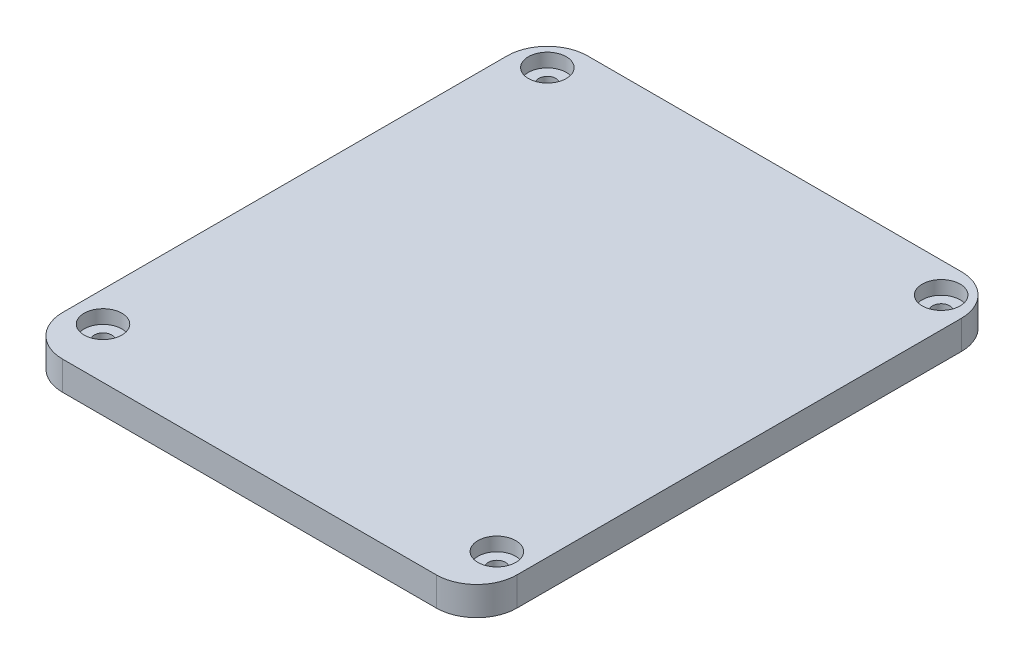
ISO-10303-21;
HEADER;
FILE_DESCRIPTION(('STEP AP214'),'2;1');
FILE_NAME('part.step','',(''),(''),'','','');
FILE_SCHEMA(('AUTOMOTIVE_DESIGN { 1 0 10303 214 1 1 1 1 }'));
ENDSEC;
DATA;
#1=APPLICATION_CONTEXT('core data for automotive mechanical design processes');
#2=APPLICATION_PROTOCOL_DEFINITION('international standard','automotive_design',2000,#1);
#3=PRODUCT_CONTEXT('',#1,'mechanical');
#4=PRODUCT('Part','Part','',(#3));
#5=PRODUCT_RELATED_PRODUCT_CATEGORY('part','',(#4));
#6=PRODUCT_DEFINITION_FORMATION('','',#4);
#7=PRODUCT_DEFINITION_CONTEXT('part definition',#1,'design');
#8=PRODUCT_DEFINITION('design','',#6,#7);
#9=PRODUCT_DEFINITION_SHAPE('','',#8);
#10=(LENGTH_UNIT() NAMED_UNIT(*) SI_UNIT(.MILLI.,.METRE.));
#11=(NAMED_UNIT(*) PLANE_ANGLE_UNIT() SI_UNIT($,.RADIAN.));
#12=(NAMED_UNIT(*) SI_UNIT($,.STERADIAN.) SOLID_ANGLE_UNIT());
#13=UNCERTAINTY_MEASURE_WITH_UNIT(LENGTH_MEASURE(1.E-05),#10,'distance_accuracy_value','');
#14=(GEOMETRIC_REPRESENTATION_CONTEXT(3) GLOBAL_UNCERTAINTY_ASSIGNED_CONTEXT((#13)) GLOBAL_UNIT_ASSIGNED_CONTEXT((#10,
#11,#12)) REPRESENTATION_CONTEXT('',''));
#15=CARTESIAN_POINT('',(0.,0.,0.));
#16=DIRECTION('',(0.,0.,1.));
#17=DIRECTION('',(1.,0.,0.));
#18=AXIS2_PLACEMENT_3D('',#15,#16,#17);
#19=CARTESIAN_POINT('',(0.,3.,0.));
#20=DIRECTION('',(0.,1.,0.));
#21=DIRECTION('',(0.,0.,1.));
#22=AXIS2_PLACEMENT_3D('',#19,#20,#21);
#23=PLANE('',#22);
#24=CARTESIAN_POINT('',(-39.,3.,-44.));
#25=DIRECTION('',(0.,1.,0.));
#26=DIRECTION('',(0.,0.,1.));
#27=AXIS2_PLACEMENT_3D('',#24,#25,#26);
#28=CIRCLE('',#27,1.7);
#29=CARTESIAN_POINT('',(-39.,3.,-42.3));
#30=VERTEX_POINT('',#29);
#31=EDGE_CURVE('E235',#30,#30,#28,.T.);
#32=ORIENTED_EDGE('',*,*,#31,.F.);
#33=EDGE_LOOP('',(#32));
#34=FACE_BOUND('',#33,.T.);
#35=CARTESIAN_POINT('',(-39.,3.,-44.));
#36=DIRECTION('',(0.,1.,0.));
#37=DIRECTION('',(0.,0.,1.));
#38=AXIS2_PLACEMENT_3D('',#35,#36,#37);
#39=CIRCLE('',#38,3.75);
#40=CARTESIAN_POINT('',(-39.,3.,-40.25));
#41=VERTEX_POINT('',#40);
#42=EDGE_CURVE('E286',#41,#41,#39,.F.);
#43=ORIENTED_EDGE('',*,*,#42,.F.);
#44=EDGE_LOOP('',(#43));
#45=FACE_BOUND('',#44,.T.);
#46=ADVANCED_FACE('F32',(#34,#45),#23,.T.);
#47=CARTESIAN_POINT('',(39.,3.,-44.));
#48=DIRECTION('',(0.,1.,0.));
#49=DIRECTION('',(0.,0.,1.));
#50=AXIS2_PLACEMENT_3D('',#47,#48,#49);
#51=CIRCLE('',#50,1.7);
#52=CARTESIAN_POINT('',(39.,3.,-42.3));
#53=VERTEX_POINT('',#52);
#54=EDGE_CURVE('E236',#53,#53,#51,.T.);
#55=ORIENTED_EDGE('',*,*,#54,.F.);
#56=EDGE_LOOP('',(#55));
#57=FACE_BOUND('',#56,.T.);
#58=CARTESIAN_POINT('',(39.,3.,-44.));
#59=DIRECTION('',(0.,1.,0.));
#60=DIRECTION('',(0.,0.,1.));
#61=AXIS2_PLACEMENT_3D('',#58,#59,#60);
#62=CIRCLE('',#61,3.75000000000001);
#63=CARTESIAN_POINT('',(39.,3.,-40.25));
#64=VERTEX_POINT('',#63);
#65=EDGE_CURVE('E283',#64,#64,#62,.F.);
#66=ORIENTED_EDGE('',*,*,#65,.F.);
#67=EDGE_LOOP('',(#66));
#68=FACE_BOUND('',#67,.T.);
#69=ADVANCED_FACE('F481',(#57,#68),#23,.T.);
#70=CARTESIAN_POINT('',(-39.,3.,44.));
#71=DIRECTION('',(0.,1.,0.));
#72=DIRECTION('',(0.,0.,1.));
#73=AXIS2_PLACEMENT_3D('',#70,#71,#72);
#74=CIRCLE('',#73,1.7);
#75=CARTESIAN_POINT('',(-39.,3.,45.7));
#76=VERTEX_POINT('',#75);
#77=EDGE_CURVE('E248',#76,#76,#74,.T.);
#78=ORIENTED_EDGE('',*,*,#77,.F.);
#79=EDGE_LOOP('',(#78));
#80=FACE_BOUND('',#79,.T.);
#81=CARTESIAN_POINT('',(-39.,3.,44.));
#82=DIRECTION('',(0.,1.,0.));
#83=DIRECTION('',(0.,0.,1.));
#84=AXIS2_PLACEMENT_3D('',#81,#82,#83);
#85=CIRCLE('',#84,3.75);
#86=CARTESIAN_POINT('',(-39.,3.,47.75));
#87=VERTEX_POINT('',#86);
#88=EDGE_CURVE('E280',#87,#87,#85,.F.);
#89=ORIENTED_EDGE('',*,*,#88,.F.);
#90=EDGE_LOOP('',(#89));
#91=FACE_BOUND('',#90,.T.);
#92=ADVANCED_FACE('F488',(#80,#91),#23,.T.);
#93=CARTESIAN_POINT('',(39.,3.,44.));
#94=DIRECTION('',(0.,1.,0.));
#95=DIRECTION('',(0.,0.,1.));
#96=AXIS2_PLACEMENT_3D('',#93,#94,#95);
#97=CIRCLE('',#96,1.7);
#98=CARTESIAN_POINT('',(39.,3.,45.7));
#99=VERTEX_POINT('',#98);
#100=EDGE_CURVE('E242',#99,#99,#97,.T.);
#101=ORIENTED_EDGE('',*,*,#100,.F.);
#102=EDGE_LOOP('',(#101));
#103=FACE_BOUND('',#102,.T.);
#104=CARTESIAN_POINT('',(39.,3.,44.));
#105=DIRECTION('',(0.,1.,0.));
#106=DIRECTION('',(0.,0.,1.));
#107=AXIS2_PLACEMENT_3D('',#104,#105,#106);
#108=CIRCLE('',#107,3.75000000000001);
#109=CARTESIAN_POINT('',(39.,3.,47.75));
#110=VERTEX_POINT('',#109);
#111=EDGE_CURVE('E277',#110,#110,#108,.F.);
#112=ORIENTED_EDGE('',*,*,#111,.F.);
#113=EDGE_LOOP('',(#112));
#114=FACE_BOUND('',#113,.T.);
#115=ADVANCED_FACE('F484',(#103,#114),#23,.T.);
#116=CARTESIAN_POINT('',(0.,-2.,0.));
#117=DIRECTION('',(0.,1.,0.));
#118=DIRECTION('',(0.,0.,1.));
#119=AXIS2_PLACEMENT_3D('',#116,#117,#118);
#120=PLANE('',#119);
#121=DIRECTION('',(-1.,0.,0.));
#122=VECTOR('',#121,1.);
#123=CARTESIAN_POINT('',(41.6,-2.,46.6));
#124=LINE('',#123,#122);
#125=CARTESIAN_POINT('',(33.5925976661617,-2.,46.6));
#126=VERTEX_POINT('',#125);
#127=CARTESIAN_POINT('',(-33.5925976661617,-2.,46.6));
#128=VERTEX_POINT('',#127);
#129=EDGE_CURVE('E251',#126,#128,#124,.T.);
#130=ORIENTED_EDGE('',*,*,#129,.T.);
#131=CARTESIAN_POINT('',(-39.,-2.,44.));
#132=DIRECTION('',(0.,1.,0.));
#133=DIRECTION('',(0.,0.,1.));
#134=AXIS2_PLACEMENT_3D('',#131,#132,#133);
#135=CIRCLE('',#134,5.99999999999997);
#136=CARTESIAN_POINT('',(-33.0133481811617,-2.,43.6));
#137=VERTEX_POINT('',#136);
#138=EDGE_CURVE('E355',#128,#137,#135,.T.);
#139=ORIENTED_EDGE('',*,*,#138,.T.);
#140=DIRECTION('',(-1.,0.,0.));
#141=VECTOR('',#140,1.);
#142=CARTESIAN_POINT('',(38.6,-2.,43.6));
#143=LINE('',#142,#141);
#144=CARTESIAN_POINT('',(33.0133481811617,-2.,43.6));
#145=VERTEX_POINT('',#144);
#146=EDGE_CURVE('E228',#145,#137,#143,.T.);
#147=ORIENTED_EDGE('',*,*,#146,.F.);
#148=CARTESIAN_POINT('',(39.,-2.,44.));
#149=DIRECTION('',(0.,1.,0.));
#150=DIRECTION('',(0.,0.,1.));
#151=AXIS2_PLACEMENT_3D('',#148,#149,#150);
#152=CIRCLE('',#151,5.99999999999997);
#153=EDGE_CURVE('E215',#145,#126,#152,.T.);
#154=ORIENTED_EDGE('',*,*,#153,.T.);
#155=EDGE_LOOP('',(#130,#139,#147,#154));
#156=FACE_BOUND('',#155,.T.);
#157=ADVANCED_FACE('F465',(#156),#120,.F.);
#158=DIRECTION('',(0.,0.,1.));
#159=VECTOR('',#158,1.);
#160=CARTESIAN_POINT('',(41.6,-2.,46.6));
#161=LINE('',#160,#159);
#162=CARTESIAN_POINT('',(41.6,-2.,-38.5925976661617));
#163=VERTEX_POINT('',#162);
#164=CARTESIAN_POINT('',(41.6,-2.,38.5925976661617));
#165=VERTEX_POINT('',#164);
#166=EDGE_CURVE('E426',#163,#165,#161,.T.);
#167=ORIENTED_EDGE('',*,*,#166,.T.);
#168=CARTESIAN_POINT('',(38.6,-2.,38.0133481811617));
#169=VERTEX_POINT('',#168);
#170=EDGE_CURVE('E199',#165,#169,#152,.T.);
#171=ORIENTED_EDGE('',*,*,#170,.T.);
#172=DIRECTION('',(0.,0.,1.));
#173=VECTOR('',#172,1.);
#174=CARTESIAN_POINT('',(38.6,-2.,43.6));
#175=LINE('',#174,#173);
#176=CARTESIAN_POINT('',(38.6,-2.,-38.0133481811617));
#177=VERTEX_POINT('',#176);
#178=EDGE_CURVE('E410',#177,#169,#175,.T.);
#179=ORIENTED_EDGE('',*,*,#178,.F.);
#180=CARTESIAN_POINT('',(39.,-2.,-44.));
#181=DIRECTION('',(0.,1.,0.));
#182=DIRECTION('',(0.,0.,1.));
#183=AXIS2_PLACEMENT_3D('',#180,#181,#182);
#184=CIRCLE('',#183,5.99999999999997);
#185=EDGE_CURVE('E365',#177,#163,#184,.T.);
#186=ORIENTED_EDGE('',*,*,#185,.T.);
#187=EDGE_LOOP('',(#167,#171,#179,#186));
#188=FACE_BOUND('',#187,.T.);
#189=ADVANCED_FACE('F500',(#188),#120,.F.);
#190=DIRECTION('',(1.,0.,0.));
#191=VECTOR('',#190,1.);
#192=CARTESIAN_POINT('',(41.6,-2.,-46.6));
#193=LINE('',#192,#191);
#194=CARTESIAN_POINT('',(-33.5925976661617,-2.,-46.6));
#195=VERTEX_POINT('',#194);
#196=CARTESIAN_POINT('',(33.5925976661617,-2.,-46.6));
#197=VERTEX_POINT('',#196);
#198=EDGE_CURVE('E423',#195,#197,#193,.T.);
#199=ORIENTED_EDGE('',*,*,#198,.T.);
#200=CARTESIAN_POINT('',(33.0133481811617,-2.,-43.6));
#201=VERTEX_POINT('',#200);
#202=EDGE_CURVE('E364',#197,#201,#184,.T.);
#203=ORIENTED_EDGE('',*,*,#202,.T.);
#204=DIRECTION('',(1.,0.,0.));
#205=VECTOR('',#204,1.);
#206=CARTESIAN_POINT('',(38.6,-2.,-43.6));
#207=LINE('',#206,#205);
#208=CARTESIAN_POINT('',(-33.0133481811617,-2.,-43.6));
#209=VERTEX_POINT('',#208);
#210=EDGE_CURVE('E406',#209,#201,#207,.T.);
#211=ORIENTED_EDGE('',*,*,#210,.F.);
#212=CARTESIAN_POINT('',(-39.,-2.,-44.));
#213=DIRECTION('',(0.,1.,0.));
#214=DIRECTION('',(0.,0.,1.));
#215=AXIS2_PLACEMENT_3D('',#212,#213,#214);
#216=CIRCLE('',#215,5.99999999999997);
#217=EDGE_CURVE('E391',#209,#195,#216,.T.);
#218=ORIENTED_EDGE('',*,*,#217,.T.);
#219=EDGE_LOOP('',(#199,#203,#211,#218));
#220=FACE_BOUND('',#219,.T.);
#221=ADVANCED_FACE('F558',(#220),#120,.F.);
#222=CARTESIAN_POINT('',(-45.,3.,50.));
#223=DIRECTION('',(1.,0.,0.));
#224=DIRECTION('',(0.,0.,-1.));
#225=AXIS2_PLACEMENT_3D('',#222,#223,#224);
#226=PLANE('',#225);
#227=DIRECTION('',(0.,0.,1.));
#228=VECTOR('',#227,1.);
#229=CARTESIAN_POINT('',(-45.,0.,50.));
#230=LINE('',#229,#228);
#231=CARTESIAN_POINT('',(-45.,0.,-42.));
#232=VERTEX_POINT('',#231);
#233=CARTESIAN_POINT('',(-45.,0.,46.));
#234=VERTEX_POINT('',#233);
#235=EDGE_CURVE('E255',#232,#234,#230,.T.);
#236=ORIENTED_EDGE('',*,*,#235,.T.);
#237=DIRECTION('',(0.,-1.,0.));
#238=VECTOR('',#237,1.);
#239=CARTESIAN_POINT('',(-45.,5.7,46.));
#240=LINE('',#239,#238);
#241=CARTESIAN_POINT('',(-45.,5.7,46.));
#242=VERTEX_POINT('',#241);
#243=EDGE_CURVE('E306',#234,#242,#240,.F.);
#244=ORIENTED_EDGE('',*,*,#243,.T.);
#245=DIRECTION('',(0.,0.,1.));
#246=VECTOR('',#245,1.);
#247=CARTESIAN_POINT('',(-45.,5.7,50.));
#248=LINE('',#247,#246);
#249=CARTESIAN_POINT('',(-45.,5.7,-42.));
#250=VERTEX_POINT('',#249);
#251=EDGE_CURVE('E344',#250,#242,#248,.T.);
#252=ORIENTED_EDGE('',*,*,#251,.F.);
#253=DIRECTION('',(0.,-1.,0.));
#254=VECTOR('',#253,1.);
#255=CARTESIAN_POINT('',(-45.,3.,-42.));
#256=LINE('',#255,#254);
#257=EDGE_CURVE('E303',#250,#232,#256,.T.);
#258=ORIENTED_EDGE('',*,*,#257,.T.);
#259=EDGE_LOOP('',(#236,#244,#252,#258));
#260=FACE_BOUND('',#259,.T.);
#261=ADVANCED_FACE('F568',(#260),#226,.F.);
#262=CARTESIAN_POINT('',(45.,3.,50.));
#263=DIRECTION('',(-1.,0.,0.));
#264=DIRECTION('',(0.,0.,1.));
#265=AXIS2_PLACEMENT_3D('',#262,#263,#264);
#266=PLANE('',#265);
#267=DIRECTION('',(0.,0.,-1.));
#268=VECTOR('',#267,1.);
#269=CARTESIAN_POINT('',(45.,5.7,54.));
#270=LINE('',#269,#268);
#271=CARTESIAN_POINT('',(45.,5.7,46.));
#272=VERTEX_POINT('',#271);
#273=CARTESIAN_POINT('',(45.,5.7,-42.));
#274=VERTEX_POINT('',#273);
#275=EDGE_CURVE('E324',#272,#274,#270,.T.);
#276=ORIENTED_EDGE('',*,*,#275,.F.);
#277=DIRECTION('',(0.,1.,0.));
#278=VECTOR('',#277,1.);
#279=CARTESIAN_POINT('',(45.,0.,46.));
#280=LINE('',#279,#278);
#281=CARTESIAN_POINT('',(45.,0.,46.));
#282=VERTEX_POINT('',#281);
#283=EDGE_CURVE('E317',#272,#282,#280,.F.);
#284=ORIENTED_EDGE('',*,*,#283,.T.);
#285=DIRECTION('',(0.,0.,-1.));
#286=VECTOR('',#285,1.);
#287=CARTESIAN_POINT('',(45.,0.,50.));
#288=LINE('',#287,#286);
#289=CARTESIAN_POINT('',(45.,0.,-42.));
#290=VERTEX_POINT('',#289);
#291=EDGE_CURVE('E260',#282,#290,#288,.T.);
#292=ORIENTED_EDGE('',*,*,#291,.T.);
#293=DIRECTION('',(0.,-1.,0.));
#294=VECTOR('',#293,1.);
#295=CARTESIAN_POINT('',(45.,3.,-42.));
#296=LINE('',#295,#294);
#297=EDGE_CURVE('E315',#290,#274,#296,.F.);
#298=ORIENTED_EDGE('',*,*,#297,.T.);
#299=EDGE_LOOP('',(#276,#284,#292,#298));
#300=FACE_BOUND('',#299,.T.);
#301=ADVANCED_FACE('F322',(#300),#266,.F.);
#302=CARTESIAN_POINT('',(45.,3.,-50.));
#303=DIRECTION('',(0.,0.,1.));
#304=DIRECTION('',(1.,0.,0.));
#305=AXIS2_PLACEMENT_3D('',#302,#303,#304);
#306=PLANE('',#305);
#307=DIRECTION('',(-1.,0.,0.));
#308=VECTOR('',#307,1.);
#309=CARTESIAN_POINT('',(45.,5.7,-50.));
#310=LINE('',#309,#308);
#311=CARTESIAN_POINT('',(37.,5.7,-50.));
#312=VERTEX_POINT('',#311);
#313=CARTESIAN_POINT('',(-37.,5.7,-50.));
#314=VERTEX_POINT('',#313);
#315=EDGE_CURVE('E346',#312,#314,#310,.T.);
#316=ORIENTED_EDGE('',*,*,#315,.F.);
#317=DIRECTION('',(0.,-1.,0.));
#318=VECTOR('',#317,1.);
#319=CARTESIAN_POINT('',(37.,3.,-50.));
#320=LINE('',#319,#318);
#321=CARTESIAN_POINT('',(37.,0.,-50.));
#322=VERTEX_POINT('',#321);
#323=EDGE_CURVE('E11',#312,#322,#320,.T.);
#324=ORIENTED_EDGE('',*,*,#323,.T.);
#325=DIRECTION('',(-1.,0.,0.));
#326=VECTOR('',#325,1.);
#327=CARTESIAN_POINT('',(45.,0.,-50.));
#328=LINE('',#327,#326);
#329=CARTESIAN_POINT('',(-37.,0.,-50.));
#330=VERTEX_POINT('',#329);
#331=EDGE_CURVE('E263',#322,#330,#328,.T.);
#332=ORIENTED_EDGE('',*,*,#331,.T.);
#333=DIRECTION('',(0.,-1.,0.));
#334=VECTOR('',#333,1.);
#335=CARTESIAN_POINT('',(-37.,3.,-50.));
#336=LINE('',#335,#334);
#337=EDGE_CURVE('E40',#330,#314,#336,.F.);
#338=ORIENTED_EDGE('',*,*,#337,.T.);
#339=EDGE_LOOP('',(#316,#324,#332,#338));
#340=FACE_BOUND('',#339,.T.);
#341=ADVANCED_FACE('F666',(#340),#306,.F.);
#342=CARTESIAN_POINT('',(0.,0.,0.));
#343=DIRECTION('',(0.,1.,0.));
#344=DIRECTION('',(0.,0.,1.));
#345=AXIS2_PLACEMENT_3D('',#342,#343,#344);
#346=PLANE('',#345);
#347=CARTESIAN_POINT('',(-39.,0.,44.));
#348=DIRECTION('',(0.,1.,0.));
#349=DIRECTION('',(0.,0.,1.));
#350=AXIS2_PLACEMENT_3D('',#347,#348,#349);
#351=CIRCLE('',#350,5.99999999999997);
#352=CARTESIAN_POINT('',(-33.5925976661617,0.,46.6));
#353=VERTEX_POINT('',#352);
#354=CARTESIAN_POINT('',(-33.0133481811617,0.,43.6));
#355=VERTEX_POINT('',#354);
#356=EDGE_CURVE('E362',#353,#355,#351,.T.);
#357=ORIENTED_EDGE('',*,*,#356,.F.);
#358=DIRECTION('',(-1.,0.,0.));
#359=VECTOR('',#358,1.);
#360=CARTESIAN_POINT('',(41.6,0.,46.6));
#361=LINE('',#360,#359);
#362=CARTESIAN_POINT('',(33.5925976661617,0.,46.6));
#363=VERTEX_POINT('',#362);
#364=EDGE_CURVE('E221',#363,#353,#361,.T.);
#365=ORIENTED_EDGE('',*,*,#364,.F.);
#366=CARTESIAN_POINT('',(39.,0.,44.));
#367=DIRECTION('',(0.,1.,0.));
#368=DIRECTION('',(0.,0.,1.));
#369=AXIS2_PLACEMENT_3D('',#366,#367,#368);
#370=CIRCLE('',#369,5.99999999999997);
#371=CARTESIAN_POINT('',(33.0133481811617,0.,43.6));
#372=VERTEX_POINT('',#371);
#373=EDGE_CURVE('E216',#372,#363,#370,.T.);
#374=ORIENTED_EDGE('',*,*,#373,.F.);
#375=DIRECTION('',(-1.,0.,0.));
#376=VECTOR('',#375,1.);
#377=CARTESIAN_POINT('',(38.6,0.,43.6));
#378=LINE('',#377,#376);
#379=EDGE_CURVE('E419',#372,#355,#378,.T.);
#380=ORIENTED_EDGE('',*,*,#379,.T.);
#381=EDGE_LOOP('',(#357,#365,#374,#380));
#382=FACE_BOUND('',#381,.T.);
#383=CARTESIAN_POINT('',(-35.6,0.,39.0563171622767));
#384=VERTEX_POINT('',#383);
#385=CARTESIAN_POINT('',(-38.6,0.,38.0133481811617));
#386=VERTEX_POINT('',#385);
#387=EDGE_CURVE('E360',#384,#386,#351,.T.);
#388=ORIENTED_EDGE('',*,*,#387,.F.);
#389=DIRECTION('',(0.,0.,-1.));
#390=VECTOR('',#389,1.);
#391=CARTESIAN_POINT('',(-35.6,0.,43.6));
#392=LINE('',#391,#390);
#393=CARTESIAN_POINT('',(-35.6,0.,-39.0563171622767));
#394=VERTEX_POINT('',#393);
#395=EDGE_CURVE('E403',#384,#394,#392,.T.);
#396=ORIENTED_EDGE('',*,*,#395,.T.);
#397=CARTESIAN_POINT('',(-39.,0.,-44.));
#398=DIRECTION('',(0.,1.,0.));
#399=DIRECTION('',(0.,0.,1.));
#400=AXIS2_PLACEMENT_3D('',#397,#398,#399);
#401=CIRCLE('',#400,5.99999999999997);
#402=CARTESIAN_POINT('',(-38.6,0.,-38.0133481811617));
#403=VERTEX_POINT('',#402);
#404=EDGE_CURVE('E392',#403,#394,#401,.T.);
#405=ORIENTED_EDGE('',*,*,#404,.F.);
#406=DIRECTION('',(0.,0.,-1.));
#407=VECTOR('',#406,1.);
#408=CARTESIAN_POINT('',(-38.6,0.,46.6));
#409=LINE('',#408,#407);
#410=EDGE_CURVE('E269',#386,#403,#409,.T.);
#411=ORIENTED_EDGE('',*,*,#410,.F.);
#412=EDGE_LOOP('',(#388,#396,#405,#411));
#413=FACE_BOUND('',#412,.T.);
#414=CARTESIAN_POINT('',(41.6,0.,38.5925976661617));
#415=VERTEX_POINT('',#414);
#416=CARTESIAN_POINT('',(38.6,0.,38.0133481811617));
#417=VERTEX_POINT('',#416);
#418=EDGE_CURVE('E196',#415,#417,#370,.T.);
#419=ORIENTED_EDGE('',*,*,#418,.F.);
#420=DIRECTION('',(0.,0.,1.));
#421=VECTOR('',#420,1.);
#422=CARTESIAN_POINT('',(41.6,0.,46.6));
#423=LINE('',#422,#421);
#424=CARTESIAN_POINT('',(41.6,0.,-38.5925976661617));
#425=VERTEX_POINT('',#424);
#426=EDGE_CURVE('E212',#425,#415,#423,.T.);
#427=ORIENTED_EDGE('',*,*,#426,.F.);
#428=CARTESIAN_POINT('',(39.,0.,-44.));
#429=DIRECTION('',(0.,1.,0.));
#430=DIRECTION('',(0.,0.,1.));
#431=AXIS2_PLACEMENT_3D('',#428,#429,#430);
#432=CIRCLE('',#431,5.99999999999997);
#433=CARTESIAN_POINT('',(38.6,0.,-38.0133481811617));
#434=VERTEX_POINT('',#433);
#435=EDGE_CURVE('E354',#434,#425,#432,.T.);
#436=ORIENTED_EDGE('',*,*,#435,.F.);
#437=DIRECTION('',(0.,0.,1.));
#438=VECTOR('',#437,1.);
#439=CARTESIAN_POINT('',(38.6,0.,43.6));
#440=LINE('',#439,#438);
#441=EDGE_CURVE('E214',#434,#417,#440,.T.);
#442=ORIENTED_EDGE('',*,*,#441,.T.);
#443=EDGE_LOOP('',(#419,#427,#436,#442));
#444=FACE_BOUND('',#443,.T.);
#445=DIRECTION('',(1.,0.,0.));
#446=VECTOR('',#445,1.);
#447=CARTESIAN_POINT('',(-45.,0.,54.));
#448=LINE('',#447,#446);
#449=CARTESIAN_POINT('',(-37.,0.,54.));
#450=VERTEX_POINT('',#449);
#451=CARTESIAN_POINT('',(37.,0.,54.));
#452=VERTEX_POINT('',#451);
#453=EDGE_CURVE('E339',#450,#452,#448,.T.);
#454=ORIENTED_EDGE('',*,*,#453,.F.);
#455=CARTESIAN_POINT('',(-37.,0.,46.));
#456=DIRECTION('',(0.,1.,0.));
#457=DIRECTION('',(0.,0.,1.));
#458=AXIS2_PLACEMENT_3D('',#455,#456,#457);
#459=CIRCLE('',#458,8.);
#460=EDGE_CURVE('E301',#450,#234,#459,.F.);
#461=ORIENTED_EDGE('',*,*,#460,.T.);
#462=ORIENTED_EDGE('',*,*,#235,.F.);
#463=CARTESIAN_POINT('',(-37.,0.,-42.));
#464=DIRECTION('',(0.,1.,0.));
#465=DIRECTION('',(0.,0.,1.));
#466=AXIS2_PLACEMENT_3D('',#463,#464,#465);
#467=CIRCLE('',#466,8.);
#468=EDGE_CURVE('E295',#232,#330,#467,.F.);
#469=ORIENTED_EDGE('',*,*,#468,.T.);
#470=ORIENTED_EDGE('',*,*,#331,.F.);
#471=CARTESIAN_POINT('',(37.,0.,-42.));
#472=DIRECTION('',(0.,1.,0.));
#473=DIRECTION('',(0.,0.,1.));
#474=AXIS2_PLACEMENT_3D('',#471,#472,#473);
#475=CIRCLE('',#474,8.);
#476=EDGE_CURVE('E297',#322,#290,#475,.F.);
#477=ORIENTED_EDGE('',*,*,#476,.T.);
#478=ORIENTED_EDGE('',*,*,#291,.F.);
#479=CARTESIAN_POINT('',(37.,0.,46.));
#480=DIRECTION('',(0.,1.,0.));
#481=DIRECTION('',(0.,0.,1.));
#482=AXIS2_PLACEMENT_3D('',#479,#480,#481);
#483=CIRCLE('',#482,8.);
#484=EDGE_CURVE('E299',#282,#452,#483,.F.);
#485=ORIENTED_EDGE('',*,*,#484,.T.);
#486=EDGE_LOOP('',(#454,#461,#462,#469,#470,#477,#478,#485));
#487=FACE_BOUND('',#486,.T.);
#488=CARTESIAN_POINT('',(33.5925976661617,0.,-46.6));
#489=VERTEX_POINT('',#488);
#490=CARTESIAN_POINT('',(33.0133481811617,0.,-43.6));
#491=VERTEX_POINT('',#490);
#492=EDGE_CURVE('E368',#489,#491,#432,.T.);
#493=ORIENTED_EDGE('',*,*,#492,.F.);
#494=DIRECTION('',(1.,0.,0.));
#495=VECTOR('',#494,1.);
#496=CARTESIAN_POINT('',(41.6,0.,-46.6));
#497=LINE('',#496,#495);
#498=CARTESIAN_POINT('',(-33.5925976661617,0.,-46.6));
#499=VERTEX_POINT('',#498);
#500=EDGE_CURVE('E222',#499,#489,#497,.T.);
#501=ORIENTED_EDGE('',*,*,#500,.F.);
#502=CARTESIAN_POINT('',(-33.0133481811617,0.,-43.6));
#503=VERTEX_POINT('',#502);
#504=EDGE_CURVE('E386',#503,#499,#401,.T.);
#505=ORIENTED_EDGE('',*,*,#504,.F.);
#506=DIRECTION('',(1.,0.,0.));
#507=VECTOR('',#506,1.);
#508=CARTESIAN_POINT('',(38.6,0.,-43.6));
#509=LINE('',#508,#507);
#510=EDGE_CURVE('E407',#503,#491,#509,.T.);
#511=ORIENTED_EDGE('',*,*,#510,.T.);
#512=EDGE_LOOP('',(#493,#501,#505,#511));
#513=FACE_BOUND('',#512,.T.);
#514=CARTESIAN_POINT('',(39.,0.,-44.));
#515=DIRECTION('',(0.,1.,0.));
#516=DIRECTION('',(0.,0.,1.));
#517=AXIS2_PLACEMENT_3D('',#514,#515,#516);
#518=CIRCLE('',#517,1.7);
#519=CARTESIAN_POINT('',(39.,0.,-42.3));
#520=VERTEX_POINT('',#519);
#521=EDGE_CURVE('E232',#520,#520,#518,.T.);
#522=ORIENTED_EDGE('',*,*,#521,.T.);
#523=EDGE_LOOP('',(#522));
#524=FACE_BOUND('',#523,.T.);
#525=CARTESIAN_POINT('',(-39.,0.,-44.));
#526=DIRECTION('',(0.,1.,0.));
#527=DIRECTION('',(0.,0.,1.));
#528=AXIS2_PLACEMENT_3D('',#525,#526,#527);
#529=CIRCLE('',#528,1.7);
#530=CARTESIAN_POINT('',(-39.,0.,-42.3));
#531=VERTEX_POINT('',#530);
#532=EDGE_CURVE('E252',#531,#531,#529,.T.);
#533=ORIENTED_EDGE('',*,*,#532,.T.);
#534=EDGE_LOOP('',(#533));
#535=FACE_BOUND('',#534,.T.);
#536=CARTESIAN_POINT('',(39.,0.,44.));
#537=DIRECTION('',(0.,1.,0.));
#538=DIRECTION('',(0.,0.,1.));
#539=AXIS2_PLACEMENT_3D('',#536,#537,#538);
#540=CIRCLE('',#539,1.7);
#541=CARTESIAN_POINT('',(39.,0.,45.7));
#542=VERTEX_POINT('',#541);
#543=EDGE_CURVE('E239',#542,#542,#540,.T.);
#544=ORIENTED_EDGE('',*,*,#543,.T.);
#545=EDGE_LOOP('',(#544));
#546=FACE_BOUND('',#545,.T.);
#547=CARTESIAN_POINT('',(-39.,0.,44.));
#548=DIRECTION('',(0.,1.,0.));
#549=DIRECTION('',(0.,0.,1.));
#550=AXIS2_PLACEMENT_3D('',#547,#548,#549);
#551=CIRCLE('',#550,1.7);
#552=CARTESIAN_POINT('',(-39.,0.,45.7));
#553=VERTEX_POINT('',#552);
#554=EDGE_CURVE('E245',#553,#553,#551,.T.);
#555=ORIENTED_EDGE('',*,*,#554,.T.);
#556=EDGE_LOOP('',(#555));
#557=FACE_BOUND('',#556,.T.);
#558=ADVANCED_FACE('F210',(#382,#413,#444,#487,#513,#524,#535,#546,#557),#346,.F.);
#559=CARTESIAN_POINT('',(-39.,0.,-44.));
#560=DIRECTION('',(0.,1.,0.));
#561=DIRECTION('',(0.,0.,1.));
#562=AXIS2_PLACEMENT_3D('',#559,#560,#561);
#563=CYLINDRICAL_SURFACE('',#562,1.7);
#564=ORIENTED_EDGE('',*,*,#532,.F.);
#565=EDGE_LOOP('',(#564));
#566=FACE_BOUND('',#565,.T.);
#567=ORIENTED_EDGE('',*,*,#31,.T.);
#568=EDGE_LOOP('',(#567));
#569=FACE_BOUND('',#568,.T.);
#570=ADVANCED_FACE('F682',(#566,#569),#563,.F.);
#571=CARTESIAN_POINT('',(-39.,0.,44.));
#572=DIRECTION('',(0.,1.,0.));
#573=DIRECTION('',(0.,0.,1.));
#574=AXIS2_PLACEMENT_3D('',#571,#572,#573);
#575=CYLINDRICAL_SURFACE('',#574,1.7);
#576=ORIENTED_EDGE('',*,*,#554,.F.);
#577=EDGE_LOOP('',(#576));
#578=FACE_BOUND('',#577,.T.);
#579=ORIENTED_EDGE('',*,*,#77,.T.);
#580=EDGE_LOOP('',(#579));
#581=FACE_BOUND('',#580,.T.);
#582=ADVANCED_FACE('F693',(#578,#581),#575,.F.);
#583=CARTESIAN_POINT('',(39.,0.,44.));
#584=DIRECTION('',(0.,1.,0.));
#585=DIRECTION('',(0.,0.,1.));
#586=AXIS2_PLACEMENT_3D('',#583,#584,#585);
#587=CYLINDRICAL_SURFACE('',#586,1.7);
#588=ORIENTED_EDGE('',*,*,#543,.F.);
#589=EDGE_LOOP('',(#588));
#590=FACE_BOUND('',#589,.T.);
#591=ORIENTED_EDGE('',*,*,#100,.T.);
#592=EDGE_LOOP('',(#591));
#593=FACE_BOUND('',#592,.T.);
#594=ADVANCED_FACE('F564',(#590,#593),#587,.F.);
#595=CARTESIAN_POINT('',(39.,0.,-44.));
#596=DIRECTION('',(0.,1.,0.));
#597=DIRECTION('',(0.,0.,1.));
#598=AXIS2_PLACEMENT_3D('',#595,#596,#597);
#599=CYLINDRICAL_SURFACE('',#598,1.7);
#600=ORIENTED_EDGE('',*,*,#521,.F.);
#601=EDGE_LOOP('',(#600));
#602=FACE_BOUND('',#601,.T.);
#603=ORIENTED_EDGE('',*,*,#54,.T.);
#604=EDGE_LOOP('',(#603));
#605=FACE_BOUND('',#604,.T.);
#606=ADVANCED_FACE('F557',(#602,#605),#599,.F.);
#607=DIRECTION('',(0.,0.,-1.));
#608=VECTOR('',#607,1.);
#609=CARTESIAN_POINT('',(-35.6,-2.,43.6));
#610=LINE('',#609,#608);
#611=CARTESIAN_POINT('',(-35.6,-2.,39.0563171622767));
#612=VERTEX_POINT('',#611);
#613=CARTESIAN_POINT('',(-35.6,-2.,-39.0563171622767));
#614=VERTEX_POINT('',#613);
#615=EDGE_CURVE('E404',#612,#614,#610,.T.);
#616=ORIENTED_EDGE('',*,*,#615,.F.);
#617=CARTESIAN_POINT('',(-38.6,-2.,38.0133481811617));
#618=VERTEX_POINT('',#617);
#619=EDGE_CURVE('E359',#612,#618,#135,.T.);
#620=ORIENTED_EDGE('',*,*,#619,.T.);
#621=DIRECTION('',(0.,0.,-1.));
#622=VECTOR('',#621,1.);
#623=CARTESIAN_POINT('',(-38.6,-2.,46.6));
#624=LINE('',#623,#622);
#625=CARTESIAN_POINT('',(-38.6,-2.,-38.0133481811617));
#626=VERTEX_POINT('',#625);
#627=EDGE_CURVE('E225',#618,#626,#624,.T.);
#628=ORIENTED_EDGE('',*,*,#627,.T.);
#629=EDGE_CURVE('E387',#626,#614,#216,.T.);
#630=ORIENTED_EDGE('',*,*,#629,.T.);
#631=EDGE_LOOP('',(#616,#620,#628,#630));
#632=FACE_BOUND('',#631,.T.);
#633=ADVANCED_FACE('F447',(#632),#120,.F.);
#634=CARTESIAN_POINT('',(-38.6,-2.,46.6));
#635=DIRECTION('',(1.,0.,0.));
#636=DIRECTION('',(0.,0.,-1.));
#637=AXIS2_PLACEMENT_3D('',#634,#635,#636);
#638=PLANE('',#637);
#639=ORIENTED_EDGE('',*,*,#627,.F.);
#640=DIRECTION('',(0.,1.,0.));
#641=VECTOR('',#640,1.);
#642=CARTESIAN_POINT('',(-38.6,-2.,38.0133481811617));
#643=LINE('',#642,#641);
#644=EDGE_CURVE('E377',#618,#386,#643,.T.);
#645=ORIENTED_EDGE('',*,*,#644,.T.);
#646=ORIENTED_EDGE('',*,*,#410,.T.);
#647=DIRECTION('',(0.,1.,0.));
#648=VECTOR('',#647,1.);
#649=CARTESIAN_POINT('',(-38.6,-2.,-38.0133481811617));
#650=LINE('',#649,#648);
#651=EDGE_CURVE('E400',#403,#626,#650,.F.);
#652=ORIENTED_EDGE('',*,*,#651,.T.);
#653=EDGE_LOOP('',(#639,#645,#646,#652));
#654=FACE_BOUND('',#653,.T.);
#655=ADVANCED_FACE('F433',(#654),#638,.F.);
#656=CARTESIAN_POINT('',(41.6,-2.,-46.6));
#657=DIRECTION('',(0.,0.,1.));
#658=DIRECTION('',(1.,0.,0.));
#659=AXIS2_PLACEMENT_3D('',#656,#657,#658);
#660=PLANE('',#659);
#661=ORIENTED_EDGE('',*,*,#500,.T.);
#662=DIRECTION('',(0.,1.,0.));
#663=VECTOR('',#662,1.);
#664=CARTESIAN_POINT('',(33.5925976661617,-2.,-46.6));
#665=LINE('',#664,#663);
#666=EDGE_CURVE('E383',#489,#197,#665,.F.);
#667=ORIENTED_EDGE('',*,*,#666,.T.);
#668=ORIENTED_EDGE('',*,*,#198,.F.);
#669=DIRECTION('',(0.,1.,0.));
#670=VECTOR('',#669,1.);
#671=CARTESIAN_POINT('',(-33.5925976661617,-2.,-46.6));
#672=LINE('',#671,#670);
#673=EDGE_CURVE('E397',#195,#499,#672,.T.);
#674=ORIENTED_EDGE('',*,*,#673,.T.);
#675=EDGE_LOOP('',(#661,#667,#668,#674));
#676=FACE_BOUND('',#675,.T.);
#677=ADVANCED_FACE('F477',(#676),#660,.F.);
#678=CARTESIAN_POINT('',(41.6,-2.,46.6));
#679=DIRECTION('',(-1.,0.,0.));
#680=DIRECTION('',(0.,0.,1.));
#681=AXIS2_PLACEMENT_3D('',#678,#679,#680);
#682=PLANE('',#681);
#683=ORIENTED_EDGE('',*,*,#426,.T.);
#684=DIRECTION('',(0.,1.,0.));
#685=VECTOR('',#684,1.);
#686=CARTESIAN_POINT('',(41.6,-2.,38.5925976661617));
#687=LINE('',#686,#685);
#688=EDGE_CURVE('E193',#415,#165,#687,.F.);
#689=ORIENTED_EDGE('',*,*,#688,.T.);
#690=ORIENTED_EDGE('',*,*,#166,.F.);
#691=DIRECTION('',(0.,1.,0.));
#692=VECTOR('',#691,1.);
#693=CARTESIAN_POINT('',(41.6,-2.,-38.5925976661617));
#694=LINE('',#693,#692);
#695=EDGE_CURVE('E220',#163,#425,#694,.T.);
#696=ORIENTED_EDGE('',*,*,#695,.T.);
#697=EDGE_LOOP('',(#683,#689,#690,#696));
#698=FACE_BOUND('',#697,.T.);
#699=ADVANCED_FACE('F219',(#698),#682,.F.);
#700=CARTESIAN_POINT('',(41.6,-2.,46.6));
#701=DIRECTION('',(0.,0.,-1.));
#702=DIRECTION('',(-1.,0.,0.));
#703=AXIS2_PLACEMENT_3D('',#700,#701,#702);
#704=PLANE('',#703);
#705=ORIENTED_EDGE('',*,*,#364,.T.);
#706=DIRECTION('',(0.,1.,0.));
#707=VECTOR('',#706,1.);
#708=CARTESIAN_POINT('',(-33.5925976661617,-2.,46.6));
#709=LINE('',#708,#707);
#710=EDGE_CURVE('E374',#353,#128,#709,.F.);
#711=ORIENTED_EDGE('',*,*,#710,.T.);
#712=ORIENTED_EDGE('',*,*,#129,.F.);
#713=DIRECTION('',(0.,1.,0.));
#714=VECTOR('',#713,1.);
#715=CARTESIAN_POINT('',(33.5925976661617,-2.,46.6));
#716=LINE('',#715,#714);
#717=EDGE_CURVE('E205',#126,#363,#716,.T.);
#718=ORIENTED_EDGE('',*,*,#717,.T.);
#719=EDGE_LOOP('',(#705,#711,#712,#718));
#720=FACE_BOUND('',#719,.T.);
#721=ADVANCED_FACE('F468',(#720),#704,.F.);
#722=CARTESIAN_POINT('',(-35.6,-2.,43.6));
#723=DIRECTION('',(1.,0.,0.));
#724=DIRECTION('',(0.,0.,-1.));
#725=AXIS2_PLACEMENT_3D('',#722,#723,#724);
#726=PLANE('',#725);
#727=DIRECTION('',(0.,1.,0.));
#728=VECTOR('',#727,1.);
#729=CARTESIAN_POINT('',(-35.6,-2.,39.0563171622767));
#730=LINE('',#729,#728);
#731=EDGE_CURVE('E204',#612,#384,#730,.T.);
#732=ORIENTED_EDGE('',*,*,#731,.F.);
#733=ORIENTED_EDGE('',*,*,#615,.T.);
#734=DIRECTION('',(0.,1.,0.));
#735=VECTOR('',#734,1.);
#736=CARTESIAN_POINT('',(-35.6,-2.,-39.0563171622767));
#737=LINE('',#736,#735);
#738=EDGE_CURVE('E390',#394,#614,#737,.F.);
#739=ORIENTED_EDGE('',*,*,#738,.F.);
#740=ORIENTED_EDGE('',*,*,#395,.F.);
#741=EDGE_LOOP('',(#732,#733,#739,#740));
#742=FACE_BOUND('',#741,.T.);
#743=ADVANCED_FACE('F444',(#742),#726,.T.);
#744=CARTESIAN_POINT('',(38.6,-2.,-43.6));
#745=DIRECTION('',(0.,0.,1.));
#746=DIRECTION('',(1.,0.,0.));
#747=AXIS2_PLACEMENT_3D('',#744,#745,#746);
#748=PLANE('',#747);
#749=DIRECTION('',(0.,1.,0.));
#750=VECTOR('',#749,1.);
#751=CARTESIAN_POINT('',(33.0133481811617,-2.,-43.6));
#752=LINE('',#751,#750);
#753=EDGE_CURVE('E380',#491,#201,#752,.F.);
#754=ORIENTED_EDGE('',*,*,#753,.F.);
#755=ORIENTED_EDGE('',*,*,#510,.F.);
#756=DIRECTION('',(0.,1.,0.));
#757=VECTOR('',#756,1.);
#758=CARTESIAN_POINT('',(-33.0133481811617,-2.,-43.6));
#759=LINE('',#758,#757);
#760=EDGE_CURVE('E265',#209,#503,#759,.T.);
#761=ORIENTED_EDGE('',*,*,#760,.F.);
#762=ORIENTED_EDGE('',*,*,#210,.T.);
#763=EDGE_LOOP('',(#754,#755,#761,#762));
#764=FACE_BOUND('',#763,.T.);
#765=ADVANCED_FACE('F475',(#764),#748,.T.);
#766=CARTESIAN_POINT('',(38.6,-2.,43.6));
#767=DIRECTION('',(-1.,0.,0.));
#768=DIRECTION('',(0.,0.,1.));
#769=AXIS2_PLACEMENT_3D('',#766,#767,#768);
#770=PLANE('',#769);
#771=DIRECTION('',(0.,1.,0.));
#772=VECTOR('',#771,1.);
#773=CARTESIAN_POINT('',(38.6,-2.,38.0133481811617));
#774=LINE('',#773,#772);
#775=EDGE_CURVE('E358',#417,#169,#774,.F.);
#776=ORIENTED_EDGE('',*,*,#775,.F.);
#777=ORIENTED_EDGE('',*,*,#441,.F.);
#778=DIRECTION('',(0.,1.,0.));
#779=VECTOR('',#778,1.);
#780=CARTESIAN_POINT('',(38.6,-2.,-38.0133481811617));
#781=LINE('',#780,#779);
#782=EDGE_CURVE('E274',#177,#434,#781,.T.);
#783=ORIENTED_EDGE('',*,*,#782,.F.);
#784=ORIENTED_EDGE('',*,*,#178,.T.);
#785=EDGE_LOOP('',(#776,#777,#783,#784));
#786=FACE_BOUND('',#785,.T.);
#787=ADVANCED_FACE('F550',(#786),#770,.T.);
#788=CARTESIAN_POINT('',(38.6,-2.,43.6));
#789=DIRECTION('',(0.,0.,-1.));
#790=DIRECTION('',(-1.,0.,0.));
#791=AXIS2_PLACEMENT_3D('',#788,#789,#790);
#792=PLANE('',#791);
#793=DIRECTION('',(0.,1.,0.));
#794=VECTOR('',#793,1.);
#795=CARTESIAN_POINT('',(-33.0133481811617,-2.,43.6));
#796=LINE('',#795,#794);
#797=EDGE_CURVE('E272',#355,#137,#796,.F.);
#798=ORIENTED_EDGE('',*,*,#797,.F.);
#799=ORIENTED_EDGE('',*,*,#379,.F.);
#800=DIRECTION('',(0.,1.,0.));
#801=VECTOR('',#800,1.);
#802=CARTESIAN_POINT('',(33.0133481811617,-2.,43.6));
#803=LINE('',#802,#801);
#804=EDGE_CURVE('E268',#145,#372,#803,.T.);
#805=ORIENTED_EDGE('',*,*,#804,.F.);
#806=ORIENTED_EDGE('',*,*,#146,.T.);
#807=EDGE_LOOP('',(#798,#799,#805,#806));
#808=FACE_BOUND('',#807,.T.);
#809=ADVANCED_FACE('F458',(#808),#792,.T.);
#810=CARTESIAN_POINT('',(-39.,-2.,-44.));
#811=DIRECTION('',(0.,1.,0.));
#812=DIRECTION('',(0.,0.,1.));
#813=AXIS2_PLACEMENT_3D('',#810,#811,#812);
#814=CYLINDRICAL_SURFACE('',#813,5.99999999999997);
#815=ORIENTED_EDGE('',*,*,#404,.T.);
#816=ORIENTED_EDGE('',*,*,#738,.T.);
#817=ORIENTED_EDGE('',*,*,#629,.F.);
#818=ORIENTED_EDGE('',*,*,#651,.F.);
#819=EDGE_LOOP('',(#815,#816,#817,#818));
#820=FACE_BOUND('',#819,.T.);
#821=ADVANCED_FACE('F439',(#820),#814,.F.);
#822=ORIENTED_EDGE('',*,*,#217,.F.);
#823=ORIENTED_EDGE('',*,*,#760,.T.);
#824=ORIENTED_EDGE('',*,*,#504,.T.);
#825=ORIENTED_EDGE('',*,*,#673,.F.);
#826=EDGE_LOOP('',(#822,#823,#824,#825));
#827=FACE_BOUND('',#826,.T.);
#828=ADVANCED_FACE('F541',(#827),#814,.F.);
#829=CARTESIAN_POINT('',(39.,-2.,44.));
#830=DIRECTION('',(0.,1.,0.));
#831=DIRECTION('',(0.,0.,1.));
#832=AXIS2_PLACEMENT_3D('',#829,#830,#831);
#833=CYLINDRICAL_SURFACE('',#832,5.99999999999997);
#834=ORIENTED_EDGE('',*,*,#418,.T.);
#835=ORIENTED_EDGE('',*,*,#775,.T.);
#836=ORIENTED_EDGE('',*,*,#170,.F.);
#837=ORIENTED_EDGE('',*,*,#688,.F.);
#838=EDGE_LOOP('',(#834,#835,#836,#837));
#839=FACE_BOUND('',#838,.T.);
#840=ADVANCED_FACE('F195',(#839),#833,.F.);
#841=ORIENTED_EDGE('',*,*,#153,.F.);
#842=ORIENTED_EDGE('',*,*,#804,.T.);
#843=ORIENTED_EDGE('',*,*,#373,.T.);
#844=ORIENTED_EDGE('',*,*,#717,.F.);
#845=EDGE_LOOP('',(#841,#842,#843,#844));
#846=FACE_BOUND('',#845,.T.);
#847=ADVANCED_FACE('F462',(#846),#833,.F.);
#848=CARTESIAN_POINT('',(-39.,-2.,44.));
#849=DIRECTION('',(0.,1.,0.));
#850=DIRECTION('',(0.,0.,1.));
#851=AXIS2_PLACEMENT_3D('',#848,#849,#850);
#852=CYLINDRICAL_SURFACE('',#851,5.99999999999997);
#853=ORIENTED_EDGE('',*,*,#619,.F.);
#854=ORIENTED_EDGE('',*,*,#731,.T.);
#855=ORIENTED_EDGE('',*,*,#387,.T.);
#856=ORIENTED_EDGE('',*,*,#644,.F.);
#857=EDGE_LOOP('',(#853,#854,#855,#856));
#858=FACE_BOUND('',#857,.T.);
#859=ADVANCED_FACE('F536',(#858),#852,.F.);
#860=ORIENTED_EDGE('',*,*,#356,.T.);
#861=ORIENTED_EDGE('',*,*,#797,.T.);
#862=ORIENTED_EDGE('',*,*,#138,.F.);
#863=ORIENTED_EDGE('',*,*,#710,.F.);
#864=EDGE_LOOP('',(#860,#861,#862,#863));
#865=FACE_BOUND('',#864,.T.);
#866=ADVANCED_FACE('F453',(#865),#852,.F.);
#867=CARTESIAN_POINT('',(39.,-2.,-44.));
#868=DIRECTION('',(0.,1.,0.));
#869=DIRECTION('',(0.,0.,1.));
#870=AXIS2_PLACEMENT_3D('',#867,#868,#869);
#871=CYLINDRICAL_SURFACE('',#870,5.99999999999997);
#872=ORIENTED_EDGE('',*,*,#492,.T.);
#873=ORIENTED_EDGE('',*,*,#753,.T.);
#874=ORIENTED_EDGE('',*,*,#202,.F.);
#875=ORIENTED_EDGE('',*,*,#666,.F.);
#876=EDGE_LOOP('',(#872,#873,#874,#875));
#877=FACE_BOUND('',#876,.T.);
#878=ADVANCED_FACE('F542',(#877),#871,.F.);
#879=ORIENTED_EDGE('',*,*,#185,.F.);
#880=ORIENTED_EDGE('',*,*,#782,.T.);
#881=ORIENTED_EDGE('',*,*,#435,.T.);
#882=ORIENTED_EDGE('',*,*,#695,.F.);
#883=EDGE_LOOP('',(#879,#880,#881,#882));
#884=FACE_BOUND('',#883,.T.);
#885=ADVANCED_FACE('F535',(#884),#871,.F.);
#886=CARTESIAN_POINT('',(0.,0.,54.));
#887=DIRECTION('',(0.,0.,1.));
#888=DIRECTION('',(1.,0.,0.));
#889=AXIS2_PLACEMENT_3D('',#886,#887,#888);
#890=PLANE('',#889);
#891=DIRECTION('',(1.,0.,0.));
#892=VECTOR('',#891,1.);
#893=CARTESIAN_POINT('',(-45.,5.7,54.));
#894=LINE('',#893,#892);
#895=CARTESIAN_POINT('',(-37.,5.7,54.));
#896=VERTEX_POINT('',#895);
#897=CARTESIAN_POINT('',(37.,5.7,54.));
#898=VERTEX_POINT('',#897);
#899=EDGE_CURVE('E337',#896,#898,#894,.T.);
#900=ORIENTED_EDGE('',*,*,#899,.F.);
#901=DIRECTION('',(0.,-1.,0.));
#902=VECTOR('',#901,1.);
#903=CARTESIAN_POINT('',(-37.,0.,54.));
#904=LINE('',#903,#902);
#905=EDGE_CURVE('E292',#896,#450,#904,.T.);
#906=ORIENTED_EDGE('',*,*,#905,.T.);
#907=ORIENTED_EDGE('',*,*,#453,.T.);
#908=DIRECTION('',(0.,1.,0.));
#909=VECTOR('',#908,1.);
#910=CARTESIAN_POINT('',(37.,5.7,54.));
#911=LINE('',#910,#909);
#912=EDGE_CURVE('E289',#452,#898,#911,.T.);
#913=ORIENTED_EDGE('',*,*,#912,.T.);
#914=EDGE_LOOP('',(#900,#906,#907,#913));
#915=FACE_BOUND('',#914,.T.);
#916=ADVANCED_FACE('F336',(#915),#890,.T.);
#917=CARTESIAN_POINT('',(0.,5.7,0.));
#918=DIRECTION('',(0.,1.,0.));
#919=DIRECTION('',(0.,0.,1.));
#920=AXIS2_PLACEMENT_3D('',#917,#918,#919);
#921=PLANE('',#920);
#922=CARTESIAN_POINT('',(-39.,5.7,44.));
#923=DIRECTION('',(0.,1.,0.));
#924=DIRECTION('',(0.,0.,1.));
#925=AXIS2_PLACEMENT_3D('',#922,#923,#924);
#926=CIRCLE('',#925,3.75);
#927=CARTESIAN_POINT('',(-39.,5.7,47.75));
#928=VERTEX_POINT('',#927);
#929=EDGE_CURVE('E931',#928,#928,#926,.T.);
#930=ORIENTED_EDGE('',*,*,#929,.F.);
#931=EDGE_LOOP('',(#930));
#932=FACE_BOUND('',#931,.T.);
#933=CARTESIAN_POINT('',(-39.,5.7,-44.));
#934=DIRECTION('',(0.,1.,0.));
#935=DIRECTION('',(0.,0.,1.));
#936=AXIS2_PLACEMENT_3D('',#933,#934,#935);
#937=CIRCLE('',#936,3.75);
#938=CARTESIAN_POINT('',(-39.,5.7,-40.25));
#939=VERTEX_POINT('',#938);
#940=EDGE_CURVE('E348',#939,#939,#937,.T.);
#941=ORIENTED_EDGE('',*,*,#940,.F.);
#942=EDGE_LOOP('',(#941));
#943=FACE_BOUND('',#942,.T.);
#944=ORIENTED_EDGE('',*,*,#251,.T.);
#945=CARTESIAN_POINT('',(-37.,5.7,46.));
#946=DIRECTION('',(0.,1.,0.));
#947=DIRECTION('',(0.,0.,1.));
#948=AXIS2_PLACEMENT_3D('',#945,#946,#947);
#949=CIRCLE('',#948,8.);
#950=EDGE_CURVE('E313',#242,#896,#949,.T.);
#951=ORIENTED_EDGE('',*,*,#950,.T.);
#952=ORIENTED_EDGE('',*,*,#899,.T.);
#953=CARTESIAN_POINT('',(37.,5.7,46.));
#954=DIRECTION('',(0.,1.,0.));
#955=DIRECTION('',(0.,0.,1.));
#956=AXIS2_PLACEMENT_3D('',#953,#954,#955);
#957=CIRCLE('',#956,8.);
#958=EDGE_CURVE('E311',#898,#272,#957,.T.);
#959=ORIENTED_EDGE('',*,*,#958,.T.);
#960=ORIENTED_EDGE('',*,*,#275,.T.);
#961=CARTESIAN_POINT('',(37.,5.7,-42.));
#962=DIRECTION('',(0.,1.,0.));
#963=DIRECTION('',(0.,0.,1.));
#964=AXIS2_PLACEMENT_3D('',#961,#962,#963);
#965=CIRCLE('',#964,8.);
#966=EDGE_CURVE('E53',#274,#312,#965,.T.);
#967=ORIENTED_EDGE('',*,*,#966,.T.);
#968=ORIENTED_EDGE('',*,*,#315,.T.);
#969=CARTESIAN_POINT('',(-37.,5.7,-42.));
#970=DIRECTION('',(0.,1.,0.));
#971=DIRECTION('',(0.,0.,1.));
#972=AXIS2_PLACEMENT_3D('',#969,#970,#971);
#973=CIRCLE('',#972,8.);
#974=EDGE_CURVE('E308',#314,#250,#973,.T.);
#975=ORIENTED_EDGE('',*,*,#974,.T.);
#976=EDGE_LOOP('',(#944,#951,#952,#959,#960,#967,#968,#975));
#977=FACE_BOUND('',#976,.T.);
#978=CARTESIAN_POINT('',(39.,5.7,-44.));
#979=DIRECTION('',(0.,1.,0.));
#980=DIRECTION('',(0.,0.,1.));
#981=AXIS2_PLACEMENT_3D('',#978,#979,#980);
#982=CIRCLE('',#981,3.75000000000001);
#983=CARTESIAN_POINT('',(39.,5.7,-40.25));
#984=VERTEX_POINT('',#983);
#985=EDGE_CURVE('E934',#984,#984,#982,.T.);
#986=ORIENTED_EDGE('',*,*,#985,.F.);
#987=EDGE_LOOP('',(#986));
#988=FACE_BOUND('',#987,.T.);
#989=CARTESIAN_POINT('',(39.,5.7,44.));
#990=DIRECTION('',(0.,1.,0.));
#991=DIRECTION('',(0.,0.,1.));
#992=AXIS2_PLACEMENT_3D('',#989,#990,#991);
#993=CIRCLE('',#992,3.75000000000001);
#994=CARTESIAN_POINT('',(39.,5.7,47.75));
#995=VERTEX_POINT('',#994);
#996=EDGE_CURVE('E939',#995,#995,#993,.T.);
#997=ORIENTED_EDGE('',*,*,#996,.F.);
#998=EDGE_LOOP('',(#997));
#999=FACE_BOUND('',#998,.T.);
#1000=ADVANCED_FACE('F341',(#932,#943,#977,#988,#999),#921,.T.);
#1001=CARTESIAN_POINT('',(-39.,5.7,-44.));
#1002=DIRECTION('',(0.,-1.,0.));
#1003=DIRECTION('',(0.,0.,-1.));
#1004=AXIS2_PLACEMENT_3D('',#1001,#1002,#1003);
#1005=CYLINDRICAL_SURFACE('',#1004,3.75);
#1006=ORIENTED_EDGE('',*,*,#940,.T.);
#1007=EDGE_LOOP('',(#1006));
#1008=FACE_BOUND('',#1007,.T.);
#1009=ORIENTED_EDGE('',*,*,#42,.T.);
#1010=EDGE_LOOP('',(#1009));
#1011=FACE_BOUND('',#1010,.T.);
#1012=ADVANCED_FACE('F525',(#1008,#1011),#1005,.F.);
#1013=CARTESIAN_POINT('',(39.,5.7,-44.));
#1014=DIRECTION('',(0.,-1.,0.));
#1015=DIRECTION('',(0.,0.,-1.));
#1016=AXIS2_PLACEMENT_3D('',#1013,#1014,#1015);
#1017=CYLINDRICAL_SURFACE('',#1016,3.75000000000001);
#1018=ORIENTED_EDGE('',*,*,#985,.T.);
#1019=EDGE_LOOP('',(#1018));
#1020=FACE_BOUND('',#1019,.T.);
#1021=ORIENTED_EDGE('',*,*,#65,.T.);
#1022=EDGE_LOOP('',(#1021));
#1023=FACE_BOUND('',#1022,.T.);
#1024=ADVANCED_FACE('F518',(#1020,#1023),#1017,.F.);
#1025=CARTESIAN_POINT('',(-39.,5.7,44.));
#1026=DIRECTION('',(0.,-1.,0.));
#1027=DIRECTION('',(0.,0.,-1.));
#1028=AXIS2_PLACEMENT_3D('',#1025,#1026,#1027);
#1029=CYLINDRICAL_SURFACE('',#1028,3.75);
#1030=ORIENTED_EDGE('',*,*,#929,.T.);
#1031=EDGE_LOOP('',(#1030));
#1032=FACE_BOUND('',#1031,.T.);
#1033=ORIENTED_EDGE('',*,*,#88,.T.);
#1034=EDGE_LOOP('',(#1033));
#1035=FACE_BOUND('',#1034,.T.);
#1036=ADVANCED_FACE('F509',(#1032,#1035),#1029,.F.);
#1037=CARTESIAN_POINT('',(39.,5.7,44.));
#1038=DIRECTION('',(0.,-1.,0.));
#1039=DIRECTION('',(0.,0.,-1.));
#1040=AXIS2_PLACEMENT_3D('',#1037,#1038,#1039);
#1041=CYLINDRICAL_SURFACE('',#1040,3.75000000000001);
#1042=ORIENTED_EDGE('',*,*,#996,.T.);
#1043=EDGE_LOOP('',(#1042));
#1044=FACE_BOUND('',#1043,.T.);
#1045=ORIENTED_EDGE('',*,*,#111,.T.);
#1046=EDGE_LOOP('',(#1045));
#1047=FACE_BOUND('',#1046,.T.);
#1048=ADVANCED_FACE('F506',(#1044,#1047),#1041,.F.);
#1049=CARTESIAN_POINT('',(-37.,0.,46.));
#1050=DIRECTION('',(0.,1.,0.));
#1051=DIRECTION('',(0.,0.,1.));
#1052=AXIS2_PLACEMENT_3D('',#1049,#1050,#1051);
#1053=CYLINDRICAL_SURFACE('',#1052,8.);
#1054=ORIENTED_EDGE('',*,*,#950,.F.);
#1055=ORIENTED_EDGE('',*,*,#243,.F.);
#1056=ORIENTED_EDGE('',*,*,#460,.F.);
#1057=ORIENTED_EDGE('',*,*,#905,.F.);
#1058=EDGE_LOOP('',(#1054,#1055,#1056,#1057));
#1059=FACE_BOUND('',#1058,.T.);
#1060=ADVANCED_FACE('F508',(#1059),#1053,.T.);
#1061=CARTESIAN_POINT('',(37.,0.,46.));
#1062=DIRECTION('',(0.,-1.,0.));
#1063=DIRECTION('',(0.,0.,-1.));
#1064=AXIS2_PLACEMENT_3D('',#1061,#1062,#1063);
#1065=CYLINDRICAL_SURFACE('',#1064,8.);
#1066=ORIENTED_EDGE('',*,*,#484,.F.);
#1067=ORIENTED_EDGE('',*,*,#283,.F.);
#1068=ORIENTED_EDGE('',*,*,#958,.F.);
#1069=ORIENTED_EDGE('',*,*,#912,.F.);
#1070=EDGE_LOOP('',(#1066,#1067,#1068,#1069));
#1071=FACE_BOUND('',#1070,.T.);
#1072=ADVANCED_FACE('F332',(#1071),#1065,.T.);
#1073=CARTESIAN_POINT('',(37.,3.,-42.));
#1074=DIRECTION('',(0.,-1.,0.));
#1075=DIRECTION('',(0.,0.,-1.));
#1076=AXIS2_PLACEMENT_3D('',#1073,#1074,#1075);
#1077=CYLINDRICAL_SURFACE('',#1076,8.);
#1078=ORIENTED_EDGE('',*,*,#966,.F.);
#1079=ORIENTED_EDGE('',*,*,#297,.F.);
#1080=ORIENTED_EDGE('',*,*,#476,.F.);
#1081=ORIENTED_EDGE('',*,*,#323,.F.);
#1082=EDGE_LOOP('',(#1078,#1079,#1080,#1081));
#1083=FACE_BOUND('',#1082,.T.);
#1084=ADVANCED_FACE('F887',(#1083),#1077,.T.);
#1085=CARTESIAN_POINT('',(-37.,3.,-42.));
#1086=DIRECTION('',(0.,-1.,0.));
#1087=DIRECTION('',(0.,0.,-1.));
#1088=AXIS2_PLACEMENT_3D('',#1085,#1086,#1087);
#1089=CYLINDRICAL_SURFACE('',#1088,8.);
#1090=ORIENTED_EDGE('',*,*,#974,.F.);
#1091=ORIENTED_EDGE('',*,*,#337,.F.);
#1092=ORIENTED_EDGE('',*,*,#468,.F.);
#1093=ORIENTED_EDGE('',*,*,#257,.F.);
#1094=EDGE_LOOP('',(#1090,#1091,#1092,#1093));
#1095=FACE_BOUND('',#1094,.T.);
#1096=ADVANCED_FACE('F34',(#1095),#1089,.T.);
#1097=CLOSED_SHELL('',(#46,#69,#92,#115,#157,#189,#221,#261,#301,#341,#558,#570,#582,#594,#606,
#633,#655,#677,#699,#721,#743,#765,#787,#809,#821,#828,#840,#847,#859,#866,#878,#885,#916,#1000,
#1012,#1024,#1036,#1048,#1060,#1072,#1084,#1096));
#1098=MANIFOLD_SOLID_BREP('B2',#1097);
#1099=ADVANCED_BREP_SHAPE_REPRESENTATION('',(#18,#1098),#14);
#1100=SHAPE_DEFINITION_REPRESENTATION(#9,#1099);
ENDSEC;
END-ISO-10303-21;
